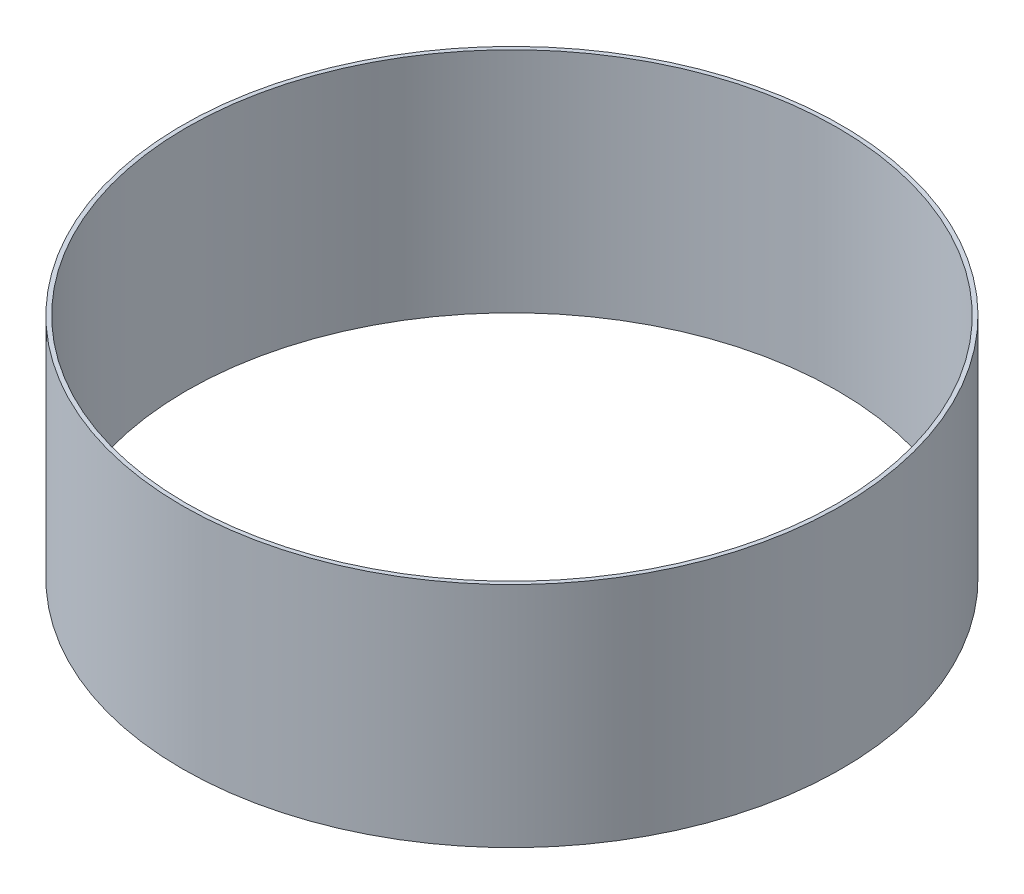
ISO-10303-21;
HEADER;
FILE_DESCRIPTION(('STEP AP214'),'2;1');
FILE_NAME('part.step','',(''),(''),'','','');
FILE_SCHEMA(('AUTOMOTIVE_DESIGN { 1 0 10303 214 1 1 1 1 }'));
ENDSEC;
DATA;
#1=APPLICATION_CONTEXT('core data for automotive mechanical design processes');
#2=APPLICATION_PROTOCOL_DEFINITION('international standard','automotive_design',2000,#1);
#3=PRODUCT_CONTEXT('',#1,'mechanical');
#4=PRODUCT('Part','Part','',(#3));
#5=PRODUCT_RELATED_PRODUCT_CATEGORY('part','',(#4));
#6=PRODUCT_DEFINITION_FORMATION('','',#4);
#7=PRODUCT_DEFINITION_CONTEXT('part definition',#1,'design');
#8=PRODUCT_DEFINITION('design','',#6,#7);
#9=PRODUCT_DEFINITION_SHAPE('','',#8);
#10=(LENGTH_UNIT() NAMED_UNIT(*) SI_UNIT(.MILLI.,.METRE.));
#11=(NAMED_UNIT(*) PLANE_ANGLE_UNIT() SI_UNIT($,.RADIAN.));
#12=(NAMED_UNIT(*) SI_UNIT($,.STERADIAN.) SOLID_ANGLE_UNIT());
#13=UNCERTAINTY_MEASURE_WITH_UNIT(LENGTH_MEASURE(1.E-05),#10,'distance_accuracy_value','');
#14=(GEOMETRIC_REPRESENTATION_CONTEXT(3) GLOBAL_UNCERTAINTY_ASSIGNED_CONTEXT((#13)) GLOBAL_UNIT_ASSIGNED_CONTEXT((#10,
#11,#12)) REPRESENTATION_CONTEXT('',''));
#15=CARTESIAN_POINT('',(0.,0.,0.));
#16=DIRECTION('',(0.,0.,1.));
#17=DIRECTION('',(1.,0.,0.));
#18=AXIS2_PLACEMENT_3D('',#15,#16,#17);
#19=CARTESIAN_POINT('',(0.,88.9,0.));
#20=DIRECTION('',(0.,1.,0.));
#21=DIRECTION('',(0.,0.,1.));
#22=AXIS2_PLACEMENT_3D('',#19,#20,#21);
#23=PLANE('',#22);
#24=CARTESIAN_POINT('',(0.,88.9,0.));
#25=DIRECTION('',(0.,1.,0.));
#26=DIRECTION('',(0.,0.,1.));
#27=AXIS2_PLACEMENT_3D('',#24,#25,#26);
#28=CIRCLE('',#27,128.5875);
#29=CARTESIAN_POINT('',(0.,88.9,128.5875));
#30=VERTEX_POINT('',#29);
#31=EDGE_CURVE('E10',#30,#30,#28,.T.);
#32=ORIENTED_EDGE('',*,*,#31,.T.);
#33=EDGE_LOOP('',(#32));
#34=FACE_BOUND('',#33,.T.);
#35=CARTESIAN_POINT('',(0.,88.9,0.));
#36=DIRECTION('',(0.,1.,0.));
#37=DIRECTION('',(0.,0.,1.));
#38=AXIS2_PLACEMENT_3D('',#35,#36,#37);
#39=CIRCLE('',#38,127.);
#40=CARTESIAN_POINT('',(0.,88.9,127.));
#41=VERTEX_POINT('',#40);
#42=EDGE_CURVE('E44',#41,#41,#39,.T.);
#43=ORIENTED_EDGE('',*,*,#42,.F.);
#44=EDGE_LOOP('',(#43));
#45=FACE_BOUND('',#44,.T.);
#46=ADVANCED_FACE('F33',(#34,#45),#23,.T.);
#47=CARTESIAN_POINT('',(0.,0.,0.));
#48=DIRECTION('',(0.,1.,0.));
#49=DIRECTION('',(0.,0.,1.));
#50=AXIS2_PLACEMENT_3D('',#47,#48,#49);
#51=PLANE('',#50);
#52=CARTESIAN_POINT('',(0.,0.,0.));
#53=DIRECTION('',(0.,1.,0.));
#54=DIRECTION('',(0.,0.,1.));
#55=AXIS2_PLACEMENT_3D('',#52,#53,#54);
#56=CIRCLE('',#55,128.5875);
#57=CARTESIAN_POINT('',(0.,0.,128.5875));
#58=VERTEX_POINT('',#57);
#59=EDGE_CURVE('E37',#58,#58,#56,.T.);
#60=ORIENTED_EDGE('',*,*,#59,.F.);
#61=EDGE_LOOP('',(#60));
#62=FACE_BOUND('',#61,.T.);
#63=CARTESIAN_POINT('',(0.,0.,0.));
#64=DIRECTION('',(0.,1.,0.));
#65=DIRECTION('',(0.,0.,1.));
#66=AXIS2_PLACEMENT_3D('',#63,#64,#65);
#67=CIRCLE('',#66,127.);
#68=CARTESIAN_POINT('',(0.,0.,127.));
#69=VERTEX_POINT('',#68);
#70=EDGE_CURVE('E46',#69,#69,#67,.T.);
#71=ORIENTED_EDGE('',*,*,#70,.T.);
#72=EDGE_LOOP('',(#71));
#73=FACE_BOUND('',#72,.T.);
#74=ADVANCED_FACE('F56',(#62,#73),#51,.F.);
#75=CARTESIAN_POINT('',(0.,88.9,0.));
#76=DIRECTION('',(0.,-1.,0.));
#77=DIRECTION('',(0.,0.,-1.));
#78=AXIS2_PLACEMENT_3D('',#75,#76,#77);
#79=CYLINDRICAL_SURFACE('',#78,128.5875);
#80=ORIENTED_EDGE('',*,*,#31,.F.);
#81=EDGE_LOOP('',(#80));
#82=FACE_BOUND('',#81,.T.);
#83=ORIENTED_EDGE('',*,*,#59,.T.);
#84=EDGE_LOOP('',(#83));
#85=FACE_BOUND('',#84,.T.);
#86=ADVANCED_FACE('F35',(#82,#85),#79,.T.);
#87=CARTESIAN_POINT('',(0.,88.9,0.));
#88=DIRECTION('',(0.,-1.,0.));
#89=DIRECTION('',(0.,0.,-1.));
#90=AXIS2_PLACEMENT_3D('',#87,#88,#89);
#91=CYLINDRICAL_SURFACE('',#90,127.);
#92=ORIENTED_EDGE('',*,*,#42,.T.);
#93=EDGE_LOOP('',(#92));
#94=FACE_BOUND('',#93,.T.);
#95=ORIENTED_EDGE('',*,*,#70,.F.);
#96=EDGE_LOOP('',(#95));
#97=FACE_BOUND('',#96,.T.);
#98=ADVANCED_FACE('F52',(#94,#97),#91,.F.);
#99=CLOSED_SHELL('',(#46,#74,#86,#98));
#100=MANIFOLD_SOLID_BREP('B2',#99);
#101=ADVANCED_BREP_SHAPE_REPRESENTATION('',(#18,#100),#14);
#102=SHAPE_DEFINITION_REPRESENTATION(#9,#101);
ENDSEC;
END-ISO-10303-21;
